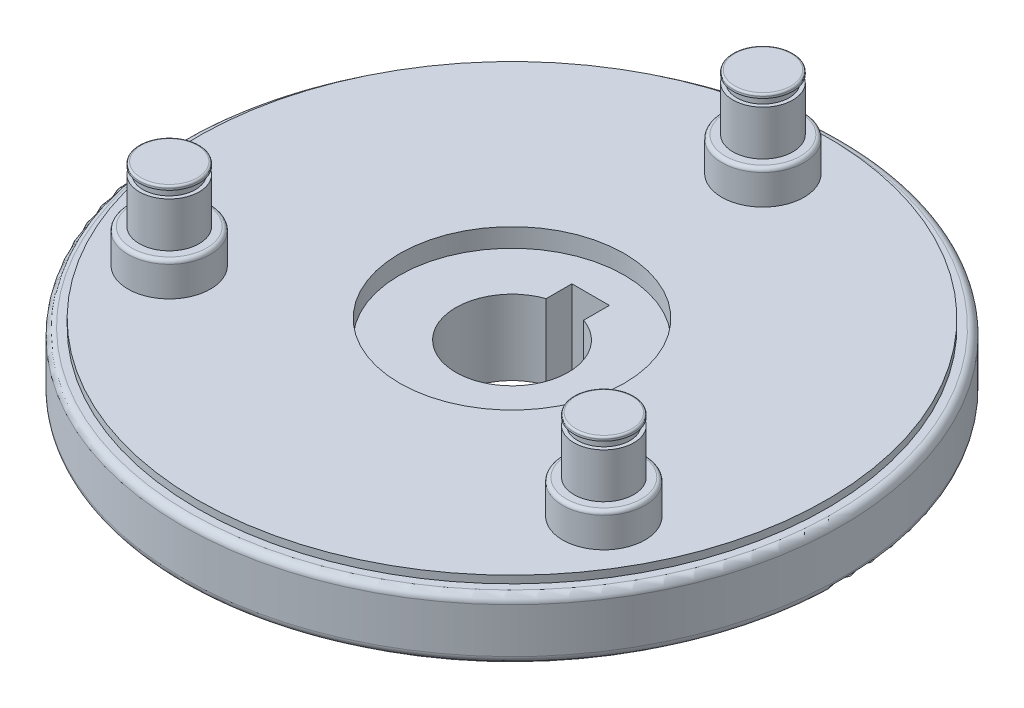
ISO-10303-21;
HEADER;
FILE_DESCRIPTION(('STEP AP214'),'2;1');
FILE_NAME('part.step','',(''),(''),'','','');
FILE_SCHEMA(('AUTOMOTIVE_DESIGN { 1 0 10303 214 1 1 1 1 }'));
ENDSEC;
DATA;
#1=APPLICATION_CONTEXT('core data for automotive mechanical design processes');
#2=APPLICATION_PROTOCOL_DEFINITION('international standard','automotive_design',2000,#1);
#3=PRODUCT_CONTEXT('',#1,'mechanical');
#4=PRODUCT('Part','Part','',(#3));
#5=PRODUCT_RELATED_PRODUCT_CATEGORY('part','',(#4));
#6=PRODUCT_DEFINITION_FORMATION('','',#4);
#7=PRODUCT_DEFINITION_CONTEXT('part definition',#1,'design');
#8=PRODUCT_DEFINITION('design','',#6,#7);
#9=PRODUCT_DEFINITION_SHAPE('','',#8);
#10=(LENGTH_UNIT() NAMED_UNIT(*) SI_UNIT(.MILLI.,.METRE.));
#11=(NAMED_UNIT(*) PLANE_ANGLE_UNIT() SI_UNIT($,.RADIAN.));
#12=(NAMED_UNIT(*) SI_UNIT($,.STERADIAN.) SOLID_ANGLE_UNIT());
#13=UNCERTAINTY_MEASURE_WITH_UNIT(LENGTH_MEASURE(1.E-05),#10,'distance_accuracy_value','');
#14=(GEOMETRIC_REPRESENTATION_CONTEXT(3) GLOBAL_UNCERTAINTY_ASSIGNED_CONTEXT((#13)) GLOBAL_UNIT_ASSIGNED_CONTEXT((#10,
#11,#12)) REPRESENTATION_CONTEXT('',''));
#15=CARTESIAN_POINT('',(0.,0.,0.));
#16=DIRECTION('',(0.,0.,1.));
#17=DIRECTION('',(1.,0.,0.));
#18=AXIS2_PLACEMENT_3D('',#15,#16,#17);
#19=CARTESIAN_POINT('',(29.0118510267788,20.5,16.7499999999997));
#20=DIRECTION('',(0.,1.,0.));
#21=DIRECTION('',(0.,0.,1.));
#22=AXIS2_PLACEMENT_3D('',#19,#20,#21);
#23=CYLINDRICAL_SURFACE('',#22,3.5);
#24=CARTESIAN_POINT('',(29.0118510267788,20.5,16.7499999999997));
#25=DIRECTION('',(0.,1.,0.));
#26=DIRECTION('',(-0.866025403784443,0.,-0.499999999999992));
#27=AXIS2_PLACEMENT_3D('',#24,#25,#26);
#28=CIRCLE('',#27,3.5);
#29=CARTESIAN_POINT('',(25.9807621135333,20.5,14.9999999999998));
#30=VERTEX_POINT('',#29);
#31=EDGE_CURVE('E195',#30,#30,#28,.T.);
#32=ORIENTED_EDGE('',*,*,#31,.T.);
#33=EDGE_LOOP('',(#32));
#34=FACE_BOUND('',#33,.T.);
#35=CARTESIAN_POINT('',(29.0118510267788,21.5,16.7499999999997));
#36=DIRECTION('',(0.,1.,0.));
#37=DIRECTION('',(0.,0.,1.));
#38=AXIS2_PLACEMENT_3D('',#35,#36,#37);
#39=CIRCLE('',#38,3.5);
#40=CARTESIAN_POINT('',(29.0118510267788,21.5,20.2499999999997));
#41=VERTEX_POINT('',#40);
#42=EDGE_CURVE('E197',#41,#41,#39,.F.);
#43=ORIENTED_EDGE('',*,*,#42,.T.);
#44=EDGE_LOOP('',(#43));
#45=FACE_BOUND('',#44,.T.);
#46=ADVANCED_FACE('F38',(#34,#45),#23,.T.);
#47=CARTESIAN_POINT('',(-29.0118510267786,20.5,16.7500000000001));
#48=DIRECTION('',(0.,1.,0.));
#49=DIRECTION('',(0.,0.,1.));
#50=AXIS2_PLACEMENT_3D('',#47,#48,#49);
#51=CYLINDRICAL_SURFACE('',#50,3.5);
#52=CARTESIAN_POINT('',(-29.0118510267786,20.5,16.7500000000001));
#53=DIRECTION('',(0.,1.,0.));
#54=DIRECTION('',(0.866025403784436,0.,-0.500000000000004));
#55=AXIS2_PLACEMENT_3D('',#52,#53,#54);
#56=CIRCLE('',#55,3.5);
#57=CARTESIAN_POINT('',(-25.9807621135331,20.5,15.0000000000001));
#58=VERTEX_POINT('',#57);
#59=EDGE_CURVE('E409',#58,#58,#56,.T.);
#60=ORIENTED_EDGE('',*,*,#59,.T.);
#61=EDGE_LOOP('',(#60));
#62=FACE_BOUND('',#61,.T.);
#63=CARTESIAN_POINT('',(-29.0118510267786,21.5,16.7500000000001));
#64=DIRECTION('',(0.,1.,0.));
#65=DIRECTION('',(0.,0.,1.));
#66=AXIS2_PLACEMENT_3D('',#63,#64,#65);
#67=CIRCLE('',#66,3.5);
#68=CARTESIAN_POINT('',(-29.0118510267786,21.5,20.2500000000001));
#69=VERTEX_POINT('',#68);
#70=EDGE_CURVE('E192',#69,#69,#67,.F.);
#71=ORIENTED_EDGE('',*,*,#70,.T.);
#72=EDGE_LOOP('',(#71));
#73=FACE_BOUND('',#72,.T.);
#74=ADVANCED_FACE('F219',(#62,#73),#51,.T.);
#75=CARTESIAN_POINT('',(29.0118510267788,14.5,16.7499999999997));
#76=DIRECTION('',(0.,1.,0.));
#77=DIRECTION('',(0.,0.,1.));
#78=AXIS2_PLACEMENT_3D('',#75,#76,#77);
#79=CYLINDRICAL_SURFACE('',#78,4.);
#80=CARTESIAN_POINT('',(29.0118510267788,14.5,16.7499999999997));
#81=DIRECTION('',(0.,1.,0.));
#82=DIRECTION('',(-0.866025403784443,0.,-0.499999999999992));
#83=AXIS2_PLACEMENT_3D('',#80,#81,#82);
#84=CIRCLE('',#83,4.);
#85=CARTESIAN_POINT('',(25.5477494116411,14.5,14.7499999999998));
#86=VERTEX_POINT('',#85);
#87=EDGE_CURVE('E401',#86,#86,#84,.T.);
#88=ORIENTED_EDGE('',*,*,#87,.T.);
#89=EDGE_LOOP('',(#88));
#90=FACE_BOUND('',#89,.T.);
#91=CARTESIAN_POINT('',(29.0118510267788,20.5,16.7499999999997));
#92=DIRECTION('',(0.,1.,0.));
#93=DIRECTION('',(-0.866025403784443,0.,-0.499999999999992));
#94=AXIS2_PLACEMENT_3D('',#91,#92,#93);
#95=CIRCLE('',#94,4.);
#96=CARTESIAN_POINT('',(25.5477494116411,20.5,14.7499999999998));
#97=VERTEX_POINT('',#96);
#98=EDGE_CURVE('E453',#97,#97,#95,.T.);
#99=ORIENTED_EDGE('',*,*,#98,.F.);
#100=EDGE_LOOP('',(#99));
#101=FACE_BOUND('',#100,.T.);
#102=ADVANCED_FACE('F225',(#90,#101),#79,.T.);
#103=CARTESIAN_POINT('',(-29.0118510267786,14.5,16.7500000000001));
#104=DIRECTION('',(0.,1.,0.));
#105=DIRECTION('',(0.,0.,1.));
#106=AXIS2_PLACEMENT_3D('',#103,#104,#105);
#107=CYLINDRICAL_SURFACE('',#106,4.);
#108=CARTESIAN_POINT('',(-29.0118510267786,14.5,16.7500000000001));
#109=DIRECTION('',(0.,1.,0.));
#110=DIRECTION('',(0.866025403784436,0.,-0.500000000000004));
#111=AXIS2_PLACEMENT_3D('',#108,#109,#110);
#112=CIRCLE('',#111,4.);
#113=CARTESIAN_POINT('',(-25.5477494116409,14.5,14.7500000000001));
#114=VERTEX_POINT('',#113);
#115=EDGE_CURVE('E402',#114,#114,#112,.T.);
#116=ORIENTED_EDGE('',*,*,#115,.T.);
#117=EDGE_LOOP('',(#116));
#118=FACE_BOUND('',#117,.T.);
#119=CARTESIAN_POINT('',(-29.0118510267786,20.5,16.7500000000001));
#120=DIRECTION('',(0.,1.,0.));
#121=DIRECTION('',(0.866025403784436,0.,-0.500000000000004));
#122=AXIS2_PLACEMENT_3D('',#119,#120,#121);
#123=CIRCLE('',#122,4.);
#124=CARTESIAN_POINT('',(-25.5477494116409,20.5,14.7500000000001));
#125=VERTEX_POINT('',#124);
#126=EDGE_CURVE('E403',#125,#125,#123,.T.);
#127=ORIENTED_EDGE('',*,*,#126,.F.);
#128=EDGE_LOOP('',(#127));
#129=FACE_BOUND('',#128,.T.);
#130=ADVANCED_FACE('F238',(#118,#129),#107,.T.);
#131=CARTESIAN_POINT('',(-29.0118510267786,22.,16.7500000000001));
#132=DIRECTION('',(0.,-1.,0.));
#133=DIRECTION('',(0.,0.,-1.));
#134=AXIS2_PLACEMENT_3D('',#131,#132,#133);
#135=CYLINDRICAL_SURFACE('',#134,5.5);
#136=CARTESIAN_POINT('',(-29.0118510267786,14.,16.7500000000001));
#137=DIRECTION('',(0.,1.,0.));
#138=DIRECTION('',(0.,0.,1.));
#139=AXIS2_PLACEMENT_3D('',#136,#137,#138);
#140=CIRCLE('',#139,5.5);
#141=CARTESIAN_POINT('',(-29.0118510267786,14.,22.2500000000001));
#142=VERTEX_POINT('',#141);
#143=EDGE_CURVE('E182',#142,#142,#140,.F.);
#144=ORIENTED_EDGE('',*,*,#143,.T.);
#145=EDGE_LOOP('',(#144));
#146=FACE_BOUND('',#145,.T.);
#147=CARTESIAN_POINT('',(-29.0118510267786,10.,16.7500000000001));
#148=DIRECTION('',(0.,1.,0.));
#149=DIRECTION('',(0.866025403784436,0.,-0.500000000000004));
#150=AXIS2_PLACEMENT_3D('',#147,#148,#149);
#151=CIRCLE('',#150,5.5);
#152=CARTESIAN_POINT('',(-24.2487113059642,10.,14.0000000000001));
#153=VERTEX_POINT('',#152);
#154=EDGE_CURVE('E415',#153,#153,#151,.T.);
#155=ORIENTED_EDGE('',*,*,#154,.T.);
#156=EDGE_LOOP('',(#155));
#157=FACE_BOUND('',#156,.T.);
#158=ADVANCED_FACE('F241',(#146,#157),#135,.T.);
#159=CARTESIAN_POINT('',(29.0118510267788,22.,16.7499999999997));
#160=DIRECTION('',(0.,-1.,0.));
#161=DIRECTION('',(0.,0.,-1.));
#162=AXIS2_PLACEMENT_3D('',#159,#160,#161);
#163=CYLINDRICAL_SURFACE('',#162,5.5);
#164=CARTESIAN_POINT('',(29.0118510267788,14.,16.7499999999997));
#165=DIRECTION('',(0.,1.,0.));
#166=DIRECTION('',(0.,0.,1.));
#167=AXIS2_PLACEMENT_3D('',#164,#165,#166);
#168=CIRCLE('',#167,5.5);
#169=CARTESIAN_POINT('',(29.0118510267788,14.,22.2499999999997));
#170=VERTEX_POINT('',#169);
#171=EDGE_CURVE('E188',#170,#170,#168,.F.);
#172=ORIENTED_EDGE('',*,*,#171,.T.);
#173=EDGE_LOOP('',(#172));
#174=FACE_BOUND('',#173,.T.);
#175=CARTESIAN_POINT('',(29.0118510267788,10.,16.7499999999997));
#176=DIRECTION('',(0.,1.,0.));
#177=DIRECTION('',(-0.866025403784443,0.,-0.499999999999992));
#178=AXIS2_PLACEMENT_3D('',#175,#176,#177);
#179=CIRCLE('',#178,5.5);
#180=CARTESIAN_POINT('',(24.2487113059644,10.,13.9999999999998));
#181=VERTEX_POINT('',#180);
#182=EDGE_CURVE('E406',#181,#181,#179,.T.);
#183=ORIENTED_EDGE('',*,*,#182,.T.);
#184=EDGE_LOOP('',(#183));
#185=FACE_BOUND('',#184,.T.);
#186=ADVANCED_FACE('F259',(#174,#185),#163,.T.);
#187=CARTESIAN_POINT('',(0.,20.5,-33.5));
#188=DIRECTION('',(0.,1.,0.));
#189=DIRECTION('',(0.,0.,1.));
#190=AXIS2_PLACEMENT_3D('',#187,#188,#189);
#191=CYLINDRICAL_SURFACE('',#190,3.5);
#192=CARTESIAN_POINT('',(0.,20.5,-33.5));
#193=DIRECTION('',(0.,1.,0.));
#194=DIRECTION('',(0.,0.,1.));
#195=AXIS2_PLACEMENT_3D('',#192,#193,#194);
#196=CIRCLE('',#195,3.5);
#197=CARTESIAN_POINT('',(0.,20.5,-30.));
#198=VERTEX_POINT('',#197);
#199=EDGE_CURVE('E172',#198,#198,#196,.T.);
#200=ORIENTED_EDGE('',*,*,#199,.T.);
#201=EDGE_LOOP('',(#200));
#202=FACE_BOUND('',#201,.T.);
#203=CARTESIAN_POINT('',(0.,21.5,-33.5));
#204=DIRECTION('',(0.,1.,0.));
#205=DIRECTION('',(0.,0.,1.));
#206=AXIS2_PLACEMENT_3D('',#203,#204,#205);
#207=CIRCLE('',#206,3.5);
#208=CARTESIAN_POINT('',(0.,21.5,-30.));
#209=VERTEX_POINT('',#208);
#210=EDGE_CURVE('E169',#209,#209,#207,.F.);
#211=ORIENTED_EDGE('',*,*,#210,.T.);
#212=EDGE_LOOP('',(#211));
#213=FACE_BOUND('',#212,.T.);
#214=ADVANCED_FACE('F262',(#202,#213),#191,.T.);
#215=CARTESIAN_POINT('',(0.,14.5,-33.5));
#216=DIRECTION('',(0.,1.,0.));
#217=DIRECTION('',(0.,0.,1.));
#218=AXIS2_PLACEMENT_3D('',#215,#216,#217);
#219=CYLINDRICAL_SURFACE('',#218,4.);
#220=CARTESIAN_POINT('',(0.,14.5,-33.5));
#221=DIRECTION('',(0.,1.,0.));
#222=DIRECTION('',(0.,0.,1.));
#223=AXIS2_PLACEMENT_3D('',#220,#221,#222);
#224=CIRCLE('',#223,4.);
#225=CARTESIAN_POINT('',(0.,14.5,-29.5));
#226=VERTEX_POINT('',#225);
#227=EDGE_CURVE('E425',#226,#226,#224,.T.);
#228=ORIENTED_EDGE('',*,*,#227,.T.);
#229=EDGE_LOOP('',(#228));
#230=FACE_BOUND('',#229,.T.);
#231=CARTESIAN_POINT('',(0.,20.5,-33.5));
#232=DIRECTION('',(0.,1.,0.));
#233=DIRECTION('',(0.,0.,1.));
#234=AXIS2_PLACEMENT_3D('',#231,#232,#233);
#235=CIRCLE('',#234,4.);
#236=CARTESIAN_POINT('',(0.,20.5,-29.5));
#237=VERTEX_POINT('',#236);
#238=EDGE_CURVE('E422',#237,#237,#235,.T.);
#239=ORIENTED_EDGE('',*,*,#238,.F.);
#240=EDGE_LOOP('',(#239));
#241=FACE_BOUND('',#240,.T.);
#242=ADVANCED_FACE('F285',(#230,#241),#219,.T.);
#243=CARTESIAN_POINT('',(0.,22.,-33.5));
#244=DIRECTION('',(0.,-1.,0.));
#245=DIRECTION('',(0.,0.,-1.));
#246=AXIS2_PLACEMENT_3D('',#243,#244,#245);
#247=CYLINDRICAL_SURFACE('',#246,5.5);
#248=CARTESIAN_POINT('',(0.,14.,-33.5));
#249=DIRECTION('',(0.,1.,0.));
#250=DIRECTION('',(0.,0.,1.));
#251=AXIS2_PLACEMENT_3D('',#248,#249,#250);
#252=CIRCLE('',#251,5.5);
#253=CARTESIAN_POINT('',(0.,14.,-28.));
#254=VERTEX_POINT('',#253);
#255=EDGE_CURVE('E165',#254,#254,#252,.F.);
#256=ORIENTED_EDGE('',*,*,#255,.T.);
#257=EDGE_LOOP('',(#256));
#258=FACE_BOUND('',#257,.T.);
#259=CARTESIAN_POINT('',(0.,10.,-33.5));
#260=DIRECTION('',(0.,1.,0.));
#261=DIRECTION('',(0.,0.,1.));
#262=AXIS2_PLACEMENT_3D('',#259,#260,#261);
#263=CIRCLE('',#262,5.5);
#264=CARTESIAN_POINT('',(0.,10.,-28.));
#265=VERTEX_POINT('',#264);
#266=EDGE_CURVE('E94',#265,#265,#263,.T.);
#267=ORIENTED_EDGE('',*,*,#266,.T.);
#268=EDGE_LOOP('',(#267));
#269=FACE_BOUND('',#268,.T.);
#270=ADVANCED_FACE('F293',(#258,#269),#247,.T.);
#271=CARTESIAN_POINT('',(0.,2.,0.));
#272=DIRECTION('',(0.,-1.,0.));
#273=DIRECTION('',(0.,0.,-1.));
#274=AXIS2_PLACEMENT_3D('',#271,#272,#273);
#275=PLANE('',#274);
#276=CARTESIAN_POINT('',(0.,2.,0.));
#277=DIRECTION('',(0.,-1.,0.));
#278=DIRECTION('',(0.,0.,-1.));
#279=AXIS2_PLACEMENT_3D('',#276,#277,#278);
#280=CIRCLE('',#279,15.);
#281=CARTESIAN_POINT('',(0.,2.,-15.));
#282=VERTEX_POINT('',#281);
#283=EDGE_CURVE('E109',#282,#282,#280,.T.);
#284=ORIENTED_EDGE('',*,*,#283,.T.);
#285=EDGE_LOOP('',(#284));
#286=FACE_BOUND('',#285,.T.);
#287=CARTESIAN_POINT('',(0.,2.,0.));
#288=DIRECTION('',(0.,-1.,0.));
#289=DIRECTION('',(0.,0.,-1.));
#290=AXIS2_PLACEMENT_3D('',#287,#288,#289);
#291=CIRCLE('',#290,13.5);
#292=CARTESIAN_POINT('',(0.,2.,-13.5));
#293=VERTEX_POINT('',#292);
#294=EDGE_CURVE('E105',#293,#293,#291,.T.);
#295=ORIENTED_EDGE('',*,*,#294,.F.);
#296=EDGE_LOOP('',(#295));
#297=FACE_BOUND('',#296,.T.);
#298=ADVANCED_FACE('F305',(#286,#297),#275,.T.);
#299=CARTESIAN_POINT('',(0.,-58.,0.));
#300=DIRECTION('',(0.,1.,0.));
#301=DIRECTION('',(0.,0.,1.));
#302=AXIS2_PLACEMENT_3D('',#299,#300,#301);
#303=CYLINDRICAL_SURFACE('',#302,7.5);
#304=DIRECTION('',(0.,1.,0.));
#305=VECTOR('',#304,1.);
#306=CARTESIAN_POINT('',(2.5,-58.,-7.07106781186548));
#307=LINE('',#306,#305);
#308=CARTESIAN_POINT('',(2.5,7.5,-7.07106781186548));
#309=VERTEX_POINT('',#308);
#310=CARTESIAN_POINT('',(2.5,-2.5,-7.07106781186547));
#311=VERTEX_POINT('',#310);
#312=EDGE_CURVE('E61',#309,#311,#307,.F.);
#313=ORIENTED_EDGE('',*,*,#312,.T.);
#314=CARTESIAN_POINT('',(0.,-2.5,0.));
#315=DIRECTION('',(0.,-1.,0.));
#316=DIRECTION('',(0.,0.,-1.));
#317=AXIS2_PLACEMENT_3D('',#314,#315,#316);
#318=CIRCLE('',#317,7.5);
#319=CARTESIAN_POINT('',(-2.5,-2.5,-7.07106781186548));
#320=VERTEX_POINT('',#319);
#321=EDGE_CURVE('E90',#311,#320,#318,.T.);
#322=ORIENTED_EDGE('',*,*,#321,.T.);
#323=DIRECTION('',(0.,1.,0.));
#324=VECTOR('',#323,1.);
#325=CARTESIAN_POINT('',(-2.5,-58.,-7.07106781186548));
#326=LINE('',#325,#324);
#327=CARTESIAN_POINT('',(-2.5,7.5,-7.07106781186548));
#328=VERTEX_POINT('',#327);
#329=EDGE_CURVE('E53',#320,#328,#326,.T.);
#330=ORIENTED_EDGE('',*,*,#329,.T.);
#331=CARTESIAN_POINT('',(0.,7.5,0.));
#332=DIRECTION('',(0.,1.,0.));
#333=DIRECTION('',(0.,0.,1.));
#334=AXIS2_PLACEMENT_3D('',#331,#332,#333);
#335=CIRCLE('',#334,7.5);
#336=EDGE_CURVE('E123',#328,#309,#335,.T.);
#337=ORIENTED_EDGE('',*,*,#336,.T.);
#338=EDGE_LOOP('',(#313,#322,#330,#337));
#339=FACE_BOUND('',#338,.T.);
#340=ADVANCED_FACE('F91',(#339),#303,.F.);
#341=CARTESIAN_POINT('',(-2.5,-58.,-10.5));
#342=DIRECTION('',(0.,0.,-1.));
#343=DIRECTION('',(-1.,0.,0.));
#344=AXIS2_PLACEMENT_3D('',#341,#342,#343);
#345=PLANE('',#344);
#346=DIRECTION('',(0.,1.,0.));
#347=VECTOR('',#346,1.);
#348=CARTESIAN_POINT('',(-2.5,-58.,-10.5));
#349=LINE('',#348,#347);
#350=CARTESIAN_POINT('',(-2.5,-2.5,-10.5));
#351=VERTEX_POINT('',#350);
#352=CARTESIAN_POINT('',(-2.5,7.5,-10.5));
#353=VERTEX_POINT('',#352);
#354=EDGE_CURVE('E121',#351,#353,#349,.T.);
#355=ORIENTED_EDGE('',*,*,#354,.F.);
#356=DIRECTION('',(1.,0.,0.));
#357=VECTOR('',#356,1.);
#358=CARTESIAN_POINT('',(-2.5,-2.5,-10.5));
#359=LINE('',#358,#357);
#360=CARTESIAN_POINT('',(2.5,-2.5,-10.5));
#361=VERTEX_POINT('',#360);
#362=EDGE_CURVE('E98',#351,#361,#359,.T.);
#363=ORIENTED_EDGE('',*,*,#362,.T.);
#364=DIRECTION('',(0.,1.,0.));
#365=VECTOR('',#364,1.);
#366=CARTESIAN_POINT('',(2.5,-58.,-10.5));
#367=LINE('',#366,#365);
#368=CARTESIAN_POINT('',(2.5,7.5,-10.5));
#369=VERTEX_POINT('',#368);
#370=EDGE_CURVE('E120',#361,#369,#367,.T.);
#371=ORIENTED_EDGE('',*,*,#370,.T.);
#372=DIRECTION('',(-1.,0.,0.));
#373=VECTOR('',#372,1.);
#374=CARTESIAN_POINT('',(-2.5,7.5,-10.5));
#375=LINE('',#374,#373);
#376=EDGE_CURVE('E116',#369,#353,#375,.T.);
#377=ORIENTED_EDGE('',*,*,#376,.T.);
#378=EDGE_LOOP('',(#355,#363,#371,#377));
#379=FACE_BOUND('',#378,.T.);
#380=ADVANCED_FACE('F326',(#379),#345,.F.);
#381=CARTESIAN_POINT('',(2.5,-58.,-4.5));
#382=DIRECTION('',(1.,0.,0.));
#383=DIRECTION('',(0.,0.,-1.));
#384=AXIS2_PLACEMENT_3D('',#381,#382,#383);
#385=PLANE('',#384);
#386=ORIENTED_EDGE('',*,*,#370,.F.);
#387=DIRECTION('',(0.,0.,1.));
#388=VECTOR('',#387,1.);
#389=CARTESIAN_POINT('',(2.5,-2.5,-10.5));
#390=LINE('',#389,#388);
#391=EDGE_CURVE('E100',#361,#311,#390,.T.);
#392=ORIENTED_EDGE('',*,*,#391,.T.);
#393=ORIENTED_EDGE('',*,*,#312,.F.);
#394=DIRECTION('',(0.,0.,-1.));
#395=VECTOR('',#394,1.);
#396=CARTESIAN_POINT('',(2.5,7.5,-4.5));
#397=LINE('',#396,#395);
#398=EDGE_CURVE('E112',#309,#369,#397,.T.);
#399=ORIENTED_EDGE('',*,*,#398,.T.);
#400=EDGE_LOOP('',(#386,#392,#393,#399));
#401=FACE_BOUND('',#400,.T.);
#402=ADVANCED_FACE('F325',(#401),#385,.F.);
#403=CARTESIAN_POINT('',(-2.5,-58.,-4.5));
#404=DIRECTION('',(-1.,0.,0.));
#405=DIRECTION('',(0.,0.,1.));
#406=AXIS2_PLACEMENT_3D('',#403,#404,#405);
#407=PLANE('',#406);
#408=ORIENTED_EDGE('',*,*,#329,.F.);
#409=DIRECTION('',(0.,0.,-1.));
#410=VECTOR('',#409,1.);
#411=CARTESIAN_POINT('',(-2.5,-2.5,-7.07106781186548));
#412=LINE('',#411,#410);
#413=EDGE_CURVE('E82',#320,#351,#412,.T.);
#414=ORIENTED_EDGE('',*,*,#413,.T.);
#415=ORIENTED_EDGE('',*,*,#354,.T.);
#416=DIRECTION('',(0.,0.,1.));
#417=VECTOR('',#416,1.);
#418=CARTESIAN_POINT('',(-2.5,7.5,-4.5));
#419=LINE('',#418,#417);
#420=EDGE_CURVE('E85',#353,#328,#419,.T.);
#421=ORIENTED_EDGE('',*,*,#420,.T.);
#422=EDGE_LOOP('',(#408,#414,#415,#421));
#423=FACE_BOUND('',#422,.T.);
#424=ADVANCED_FACE('F80',(#423),#407,.F.);
#425=CARTESIAN_POINT('',(0.,10.,0.));
#426=DIRECTION('',(0.,-1.,0.));
#427=DIRECTION('',(0.,0.,-1.));
#428=AXIS2_PLACEMENT_3D('',#425,#426,#427);
#429=CYLINDRICAL_SURFACE('',#428,44.);
#430=CARTESIAN_POINT('',(0.,2.,0.));
#431=DIRECTION('',(0.,-1.,0.));
#432=DIRECTION('',(0.,0.,-1.));
#433=AXIS2_PLACEMENT_3D('',#430,#431,#432);
#434=CIRCLE('',#433,44.);
#435=CARTESIAN_POINT('',(0.,2.,-44.));
#436=VERTEX_POINT('',#435);
#437=EDGE_CURVE('E147',#436,#436,#434,.F.);
#438=ORIENTED_EDGE('',*,*,#437,.T.);
#439=EDGE_LOOP('',(#438));
#440=FACE_BOUND('',#439,.T.);
#441=CARTESIAN_POINT('',(0.,8.,0.));
#442=DIRECTION('',(0.,1.,0.));
#443=DIRECTION('',(0.,0.,1.));
#444=AXIS2_PLACEMENT_3D('',#441,#442,#443);
#445=CIRCLE('',#444,44.);
#446=CARTESIAN_POINT('',(0.,8.,44.));
#447=VERTEX_POINT('',#446);
#448=EDGE_CURVE('E142',#447,#447,#445,.F.);
#449=ORIENTED_EDGE('',*,*,#448,.T.);
#450=EDGE_LOOP('',(#449));
#451=FACE_BOUND('',#450,.T.);
#452=ADVANCED_FACE('F324',(#440,#451),#429,.T.);
#453=CARTESIAN_POINT('',(0.,9.,0.));
#454=DIRECTION('',(0.,1.,0.));
#455=DIRECTION('',(0.,0.,1.));
#456=AXIS2_PLACEMENT_3D('',#453,#454,#455);
#457=PLANE('',#456);
#458=CARTESIAN_POINT('',(0.,9.,0.));
#459=DIRECTION('',(0.,1.,0.));
#460=DIRECTION('',(0.,0.,1.));
#461=AXIS2_PLACEMENT_3D('',#458,#459,#460);
#462=CIRCLE('',#461,43.);
#463=CARTESIAN_POINT('',(0.,9.,43.));
#464=VERTEX_POINT('',#463);
#465=EDGE_CURVE('E87',#464,#464,#462,.T.);
#466=ORIENTED_EDGE('',*,*,#465,.T.);
#467=EDGE_LOOP('',(#466));
#468=FACE_BOUND('',#467,.T.);
#469=CARTESIAN_POINT('',(0.,9.,0.));
#470=DIRECTION('',(0.,1.,0.));
#471=DIRECTION('',(0.,0.,1.));
#472=AXIS2_PLACEMENT_3D('',#469,#470,#471);
#473=CIRCLE('',#472,42.);
#474=CARTESIAN_POINT('',(0.,9.,42.));
#475=VERTEX_POINT('',#474);
#476=EDGE_CURVE('E139',#475,#475,#473,.T.);
#477=ORIENTED_EDGE('',*,*,#476,.F.);
#478=EDGE_LOOP('',(#477));
#479=FACE_BOUND('',#478,.T.);
#480=ADVANCED_FACE('F355',(#468,#479),#457,.T.);
#481=CARTESIAN_POINT('',(0.,9.,0.));
#482=DIRECTION('',(0.,1.,0.));
#483=DIRECTION('',(0.,0.,1.));
#484=AXIS2_PLACEMENT_3D('',#481,#482,#483);
#485=CYLINDRICAL_SURFACE('',#484,42.);
#486=ORIENTED_EDGE('',*,*,#476,.T.);
#487=EDGE_LOOP('',(#486));
#488=FACE_BOUND('',#487,.T.);
#489=CARTESIAN_POINT('',(0.,10.,0.));
#490=DIRECTION('',(0.,1.,0.));
#491=DIRECTION('',(0.,0.,1.));
#492=AXIS2_PLACEMENT_3D('',#489,#490,#491);
#493=CIRCLE('',#492,42.);
#494=CARTESIAN_POINT('',(0.,10.,42.));
#495=VERTEX_POINT('',#494);
#496=EDGE_CURVE('E136',#495,#495,#493,.T.);
#497=ORIENTED_EDGE('',*,*,#496,.F.);
#498=EDGE_LOOP('',(#497));
#499=FACE_BOUND('',#498,.T.);
#500=ADVANCED_FACE('F352',(#488,#499),#485,.T.);
#501=CARTESIAN_POINT('',(0.,10.,0.));
#502=DIRECTION('',(0.,1.,0.));
#503=DIRECTION('',(0.,0.,1.));
#504=AXIS2_PLACEMENT_3D('',#501,#502,#503);
#505=PLANE('',#504);
#506=ORIENTED_EDGE('',*,*,#182,.F.);
#507=EDGE_LOOP('',(#506));
#508=FACE_BOUND('',#507,.T.);
#509=ORIENTED_EDGE('',*,*,#154,.F.);
#510=EDGE_LOOP('',(#509));
#511=FACE_BOUND('',#510,.T.);
#512=ORIENTED_EDGE('',*,*,#266,.F.);
#513=EDGE_LOOP('',(#512));
#514=FACE_BOUND('',#513,.T.);
#515=CARTESIAN_POINT('',(0.,10.,0.));
#516=DIRECTION('',(0.,1.,0.));
#517=DIRECTION('',(0.,0.,1.));
#518=AXIS2_PLACEMENT_3D('',#515,#516,#517);
#519=CIRCLE('',#518,15.);
#520=CARTESIAN_POINT('',(0.,10.,15.));
#521=VERTEX_POINT('',#520);
#522=EDGE_CURVE('E126',#521,#521,#519,.T.);
#523=ORIENTED_EDGE('',*,*,#522,.F.);
#524=EDGE_LOOP('',(#523));
#525=FACE_BOUND('',#524,.T.);
#526=ORIENTED_EDGE('',*,*,#496,.T.);
#527=EDGE_LOOP('',(#526));
#528=FACE_BOUND('',#527,.T.);
#529=ADVANCED_FACE('F350',(#508,#511,#514,#525,#528),#505,.T.);
#530=CARTESIAN_POINT('',(0.,1.,0.));
#531=DIRECTION('',(0.,-1.,0.));
#532=DIRECTION('',(0.,0.,1.));
#533=AXIS2_PLACEMENT_3D('',#530,#531,#532);
#534=PLANE('',#533);
#535=CARTESIAN_POINT('',(0.,1.,0.));
#536=DIRECTION('',(0.,-1.,0.));
#537=DIRECTION('',(0.,0.,-1.));
#538=AXIS2_PLACEMENT_3D('',#535,#536,#537);
#539=CIRCLE('',#538,43.);
#540=CARTESIAN_POINT('',(0.,1.,-43.));
#541=VERTEX_POINT('',#540);
#542=EDGE_CURVE('E150',#541,#541,#539,.T.);
#543=ORIENTED_EDGE('',*,*,#542,.T.);
#544=EDGE_LOOP('',(#543));
#545=FACE_BOUND('',#544,.T.);
#546=CARTESIAN_POINT('',(0.,1.,0.));
#547=DIRECTION('',(0.,1.,0.));
#548=DIRECTION('',(0.,0.,1.));
#549=AXIS2_PLACEMENT_3D('',#546,#547,#548);
#550=CIRCLE('',#549,42.);
#551=CARTESIAN_POINT('',(0.,1.,42.));
#552=VERTEX_POINT('',#551);
#553=EDGE_CURVE('E133',#552,#552,#550,.T.);
#554=ORIENTED_EDGE('',*,*,#553,.T.);
#555=EDGE_LOOP('',(#554));
#556=FACE_BOUND('',#555,.T.);
#557=ADVANCED_FACE('F346',(#545,#556),#534,.T.);
#558=CARTESIAN_POINT('',(0.,1.,0.));
#559=DIRECTION('',(0.,-1.,0.));
#560=DIRECTION('',(0.,0.,-1.));
#561=AXIS2_PLACEMENT_3D('',#558,#559,#560);
#562=CYLINDRICAL_SURFACE('',#561,42.);
#563=ORIENTED_EDGE('',*,*,#553,.F.);
#564=EDGE_LOOP('',(#563));
#565=FACE_BOUND('',#564,.T.);
#566=CARTESIAN_POINT('',(0.,0.,0.));
#567=DIRECTION('',(0.,1.,0.));
#568=DIRECTION('',(0.,0.,1.));
#569=AXIS2_PLACEMENT_3D('',#566,#567,#568);
#570=CIRCLE('',#569,42.);
#571=CARTESIAN_POINT('',(0.,0.,42.));
#572=VERTEX_POINT('',#571);
#573=EDGE_CURVE('E130',#572,#572,#570,.T.);
#574=ORIENTED_EDGE('',*,*,#573,.T.);
#575=EDGE_LOOP('',(#574));
#576=FACE_BOUND('',#575,.T.);
#577=ADVANCED_FACE('F342',(#565,#576),#562,.T.);
#578=CARTESIAN_POINT('',(0.,0.,0.));
#579=DIRECTION('',(0.,1.,0.));
#580=DIRECTION('',(0.,0.,1.));
#581=AXIS2_PLACEMENT_3D('',#578,#579,#580);
#582=PLANE('',#581);
#583=CARTESIAN_POINT('',(0.,0.,0.));
#584=DIRECTION('',(0.,-1.,0.));
#585=DIRECTION('',(0.,0.,-1.));
#586=AXIS2_PLACEMENT_3D('',#583,#584,#585);
#587=CIRCLE('',#586,15.);
#588=CARTESIAN_POINT('',(0.,0.,-15.));
#589=VERTEX_POINT('',#588);
#590=EDGE_CURVE('E108',#589,#589,#587,.T.);
#591=ORIENTED_EDGE('',*,*,#590,.F.);
#592=EDGE_LOOP('',(#591));
#593=FACE_BOUND('',#592,.T.);
#594=ORIENTED_EDGE('',*,*,#573,.F.);
#595=EDGE_LOOP('',(#594));
#596=FACE_BOUND('',#595,.T.);
#597=ADVANCED_FACE('F345',(#593,#596),#582,.F.);
#598=CARTESIAN_POINT('',(0.,2.,0.));
#599=DIRECTION('',(0.,-1.,0.));
#600=DIRECTION('',(0.,0.,-1.));
#601=AXIS2_PLACEMENT_3D('',#598,#599,#600);
#602=TOROIDAL_SURFACE('',#601,43.,1.);
#603=ORIENTED_EDGE('',*,*,#542,.F.);
#604=EDGE_LOOP('',(#603));
#605=FACE_BOUND('',#604,.T.);
#606=ORIENTED_EDGE('',*,*,#437,.F.);
#607=EDGE_LOOP('',(#606));
#608=FACE_BOUND('',#607,.T.);
#609=ADVANCED_FACE('F365',(#605,#608),#602,.T.);
#610=CARTESIAN_POINT('',(0.,8.,0.));
#611=DIRECTION('',(0.,1.,0.));
#612=DIRECTION('',(0.,0.,1.));
#613=AXIS2_PLACEMENT_3D('',#610,#611,#612);
#614=TOROIDAL_SURFACE('',#613,43.,1.);
#615=ORIENTED_EDGE('',*,*,#448,.F.);
#616=EDGE_LOOP('',(#615));
#617=FACE_BOUND('',#616,.T.);
#618=ORIENTED_EDGE('',*,*,#465,.F.);
#619=EDGE_LOOP('',(#618));
#620=FACE_BOUND('',#619,.T.);
#621=ADVANCED_FACE('F340',(#617,#620),#614,.T.);
#622=CARTESIAN_POINT('',(0.,7.5,0.));
#623=DIRECTION('',(0.,1.,0.));
#624=DIRECTION('',(0.,0.,1.));
#625=AXIS2_PLACEMENT_3D('',#622,#623,#624);
#626=CYLINDRICAL_SURFACE('',#625,15.);
#627=CARTESIAN_POINT('',(0.,7.5,0.));
#628=DIRECTION('',(0.,1.,0.));
#629=DIRECTION('',(0.,0.,1.));
#630=AXIS2_PLACEMENT_3D('',#627,#628,#629);
#631=CIRCLE('',#630,15.);
#632=CARTESIAN_POINT('',(0.,7.5,15.));
#633=VERTEX_POINT('',#632);
#634=EDGE_CURVE('E127',#633,#633,#631,.T.);
#635=ORIENTED_EDGE('',*,*,#634,.F.);
#636=EDGE_LOOP('',(#635));
#637=FACE_BOUND('',#636,.T.);
#638=ORIENTED_EDGE('',*,*,#522,.T.);
#639=EDGE_LOOP('',(#638));
#640=FACE_BOUND('',#639,.T.);
#641=ADVANCED_FACE('F336',(#637,#640),#626,.F.);
#642=CARTESIAN_POINT('',(0.,7.5,0.));
#643=DIRECTION('',(0.,1.,0.));
#644=DIRECTION('',(0.,0.,1.));
#645=AXIS2_PLACEMENT_3D('',#642,#643,#644);
#646=PLANE('',#645);
#647=ORIENTED_EDGE('',*,*,#398,.F.);
#648=ORIENTED_EDGE('',*,*,#336,.F.);
#649=ORIENTED_EDGE('',*,*,#420,.F.);
#650=ORIENTED_EDGE('',*,*,#376,.F.);
#651=EDGE_LOOP('',(#647,#648,#649,#650));
#652=FACE_BOUND('',#651,.T.);
#653=ORIENTED_EDGE('',*,*,#634,.T.);
#654=EDGE_LOOP('',(#653));
#655=FACE_BOUND('',#654,.T.);
#656=ADVANCED_FACE('F320',(#652,#655),#646,.T.);
#657=CARTESIAN_POINT('',(0.,2.,0.));
#658=DIRECTION('',(0.,-1.,0.));
#659=DIRECTION('',(0.,0.,-1.));
#660=AXIS2_PLACEMENT_3D('',#657,#658,#659);
#661=CYLINDRICAL_SURFACE('',#660,15.);
#662=ORIENTED_EDGE('',*,*,#283,.F.);
#663=EDGE_LOOP('',(#662));
#664=FACE_BOUND('',#663,.T.);
#665=ORIENTED_EDGE('',*,*,#590,.T.);
#666=EDGE_LOOP('',(#665));
#667=FACE_BOUND('',#666,.T.);
#668=ADVANCED_FACE('F310',(#664,#667),#661,.F.);
#669=CARTESIAN_POINT('',(0.,-2.5,0.));
#670=DIRECTION('',(0.,-1.,0.));
#671=DIRECTION('',(0.,0.,-1.));
#672=AXIS2_PLACEMENT_3D('',#669,#670,#671);
#673=PLANE('',#672);
#674=CARTESIAN_POINT('',(0.,-2.5,0.));
#675=DIRECTION('',(0.,-1.,0.));
#676=DIRECTION('',(0.,0.,-1.));
#677=AXIS2_PLACEMENT_3D('',#674,#675,#676);
#678=CIRCLE('',#677,12.);
#679=CARTESIAN_POINT('',(0.,-2.5,-12.));
#680=VERTEX_POINT('',#679);
#681=EDGE_CURVE('E156',#680,#680,#678,.T.);
#682=ORIENTED_EDGE('',*,*,#681,.T.);
#683=EDGE_LOOP('',(#682));
#684=FACE_BOUND('',#683,.T.);
#685=ORIENTED_EDGE('',*,*,#413,.F.);
#686=ORIENTED_EDGE('',*,*,#321,.F.);
#687=ORIENTED_EDGE('',*,*,#391,.F.);
#688=ORIENTED_EDGE('',*,*,#362,.F.);
#689=EDGE_LOOP('',(#685,#686,#687,#688));
#690=FACE_BOUND('',#689,.T.);
#691=ADVANCED_FACE('F96',(#684,#690),#673,.T.);
#692=CARTESIAN_POINT('',(0.,-2.5,0.));
#693=DIRECTION('',(0.,1.,0.));
#694=DIRECTION('',(0.,0.,1.));
#695=AXIS2_PLACEMENT_3D('',#692,#693,#694);
#696=CYLINDRICAL_SURFACE('',#695,13.5);
#697=CARTESIAN_POINT('',(0.,-0.99999999999999,0.));
#698=DIRECTION('',(0.,-1.,0.));
#699=DIRECTION('',(0.,0.,-1.));
#700=AXIS2_PLACEMENT_3D('',#697,#698,#699);
#701=CIRCLE('',#700,13.5);
#702=CARTESIAN_POINT('',(0.,-0.99999999999999,-13.5));
#703=VERTEX_POINT('',#702);
#704=EDGE_CURVE('E159',#703,#703,#701,.F.);
#705=ORIENTED_EDGE('',*,*,#704,.T.);
#706=EDGE_LOOP('',(#705));
#707=FACE_BOUND('',#706,.T.);
#708=ORIENTED_EDGE('',*,*,#294,.T.);
#709=EDGE_LOOP('',(#708));
#710=FACE_BOUND('',#709,.T.);
#711=ADVANCED_FACE('F309',(#707,#710),#696,.T.);
#712=CARTESIAN_POINT('',(0.,-2.5,0.));
#713=DIRECTION('',(0.,1.,0.));
#714=DIRECTION('',(0.,0.,1.));
#715=AXIS2_PLACEMENT_3D('',#712,#713,#714);
#716=CONICAL_SURFACE('',#715,12.,0.785398163397447);
#717=ORIENTED_EDGE('',*,*,#704,.F.);
#718=EDGE_LOOP('',(#717));
#719=FACE_BOUND('',#718,.T.);
#720=ORIENTED_EDGE('',*,*,#681,.F.);
#721=EDGE_LOOP('',(#720));
#722=FACE_BOUND('',#721,.T.);
#723=ADVANCED_FACE('F298',(#719,#722),#716,.T.);
#724=CARTESIAN_POINT('',(0.,14.5,-33.5));
#725=DIRECTION('',(0.,1.,0.));
#726=DIRECTION('',(0.,0.,1.));
#727=AXIS2_PLACEMENT_3D('',#724,#725,#726);
#728=PLANE('',#727);
#729=CARTESIAN_POINT('',(0.,14.5,-33.5));
#730=DIRECTION('',(0.,1.,0.));
#731=DIRECTION('',(0.,0.,1.));
#732=AXIS2_PLACEMENT_3D('',#729,#730,#731);
#733=CIRCLE('',#732,5.);
#734=CARTESIAN_POINT('',(0.,14.5,-28.5));
#735=VERTEX_POINT('',#734);
#736=EDGE_CURVE('E162',#735,#735,#733,.T.);
#737=ORIENTED_EDGE('',*,*,#736,.T.);
#738=EDGE_LOOP('',(#737));
#739=FACE_BOUND('',#738,.T.);
#740=ORIENTED_EDGE('',*,*,#227,.F.);
#741=EDGE_LOOP('',(#740));
#742=FACE_BOUND('',#741,.T.);
#743=ADVANCED_FACE('F295',(#739,#742),#728,.T.);
#744=CARTESIAN_POINT('',(0.,14.,-33.5));
#745=DIRECTION('',(0.,1.,0.));
#746=DIRECTION('',(0.,0.,1.));
#747=AXIS2_PLACEMENT_3D('',#744,#745,#746);
#748=TOROIDAL_SURFACE('',#747,5.,0.5);
#749=ORIENTED_EDGE('',*,*,#255,.F.);
#750=EDGE_LOOP('',(#749));
#751=FACE_BOUND('',#750,.T.);
#752=ORIENTED_EDGE('',*,*,#736,.F.);
#753=EDGE_LOOP('',(#752));
#754=FACE_BOUND('',#753,.T.);
#755=ADVANCED_FACE('F289',(#751,#754),#748,.T.);
#756=CARTESIAN_POINT('',(0.,20.5,-33.5));
#757=DIRECTION('',(0.,1.,0.));
#758=DIRECTION('',(0.,0.,1.));
#759=AXIS2_PLACEMENT_3D('',#756,#757,#758);
#760=PLANE('',#759);
#761=ORIENTED_EDGE('',*,*,#199,.F.);
#762=EDGE_LOOP('',(#761));
#763=FACE_BOUND('',#762,.T.);
#764=ORIENTED_EDGE('',*,*,#238,.T.);
#765=EDGE_LOOP('',(#764));
#766=FACE_BOUND('',#765,.T.);
#767=ADVANCED_FACE('F281',(#763,#766),#760,.T.);
#768=CARTESIAN_POINT('',(0.,21.5,-33.5));
#769=DIRECTION('',(0.,1.,0.));
#770=DIRECTION('',(0.,0.,1.));
#771=AXIS2_PLACEMENT_3D('',#768,#769,#770);
#772=CYLINDRICAL_SURFACE('',#771,4.);
#773=CARTESIAN_POINT('',(0.,21.75,-33.5));
#774=DIRECTION('',(0.,1.,0.));
#775=DIRECTION('',(0.,0.,1.));
#776=AXIS2_PLACEMENT_3D('',#773,#774,#775);
#777=CIRCLE('',#776,4.);
#778=CARTESIAN_POINT('',(0.,21.75,-29.5));
#779=VERTEX_POINT('',#778);
#780=EDGE_CURVE('E176',#779,#779,#777,.F.);
#781=ORIENTED_EDGE('',*,*,#780,.T.);
#782=EDGE_LOOP('',(#781));
#783=FACE_BOUND('',#782,.T.);
#784=CARTESIAN_POINT('',(0.,21.5,-33.5));
#785=DIRECTION('',(0.,1.,0.));
#786=DIRECTION('',(0.,0.,1.));
#787=AXIS2_PLACEMENT_3D('',#784,#785,#786);
#788=CIRCLE('',#787,4.);
#789=CARTESIAN_POINT('',(0.,21.5,-29.5));
#790=VERTEX_POINT('',#789);
#791=EDGE_CURVE('E173',#790,#790,#788,.T.);
#792=ORIENTED_EDGE('',*,*,#791,.T.);
#793=EDGE_LOOP('',(#792));
#794=FACE_BOUND('',#793,.T.);
#795=ADVANCED_FACE('F277',(#783,#794),#772,.T.);
#796=CARTESIAN_POINT('',(0.,21.5,-33.5));
#797=DIRECTION('',(0.,1.,0.));
#798=DIRECTION('',(0.,0.,1.));
#799=AXIS2_PLACEMENT_3D('',#796,#797,#798);
#800=PLANE('',#799);
#801=ORIENTED_EDGE('',*,*,#210,.F.);
#802=EDGE_LOOP('',(#801));
#803=FACE_BOUND('',#802,.T.);
#804=ORIENTED_EDGE('',*,*,#791,.F.);
#805=EDGE_LOOP('',(#804));
#806=FACE_BOUND('',#805,.T.);
#807=ADVANCED_FACE('F273',(#803,#806),#800,.F.);
#808=CARTESIAN_POINT('',(0.,22.,-33.5));
#809=DIRECTION('',(0.,1.,0.));
#810=DIRECTION('',(0.,0.,1.));
#811=AXIS2_PLACEMENT_3D('',#808,#809,#810);
#812=PLANE('',#811);
#813=CARTESIAN_POINT('',(0.,22.,-33.5));
#814=DIRECTION('',(0.,1.,0.));
#815=DIRECTION('',(0.,0.,1.));
#816=AXIS2_PLACEMENT_3D('',#813,#814,#815);
#817=CIRCLE('',#816,3.75);
#818=CARTESIAN_POINT('',(0.,22.,-29.75));
#819=VERTEX_POINT('',#818);
#820=EDGE_CURVE('E168',#819,#819,#817,.T.);
#821=ORIENTED_EDGE('',*,*,#820,.T.);
#822=EDGE_LOOP('',(#821));
#823=FACE_BOUND('',#822,.T.);
#824=ADVANCED_FACE('F276',(#823),#812,.T.);
#825=CARTESIAN_POINT('',(0.,21.75,-33.5));
#826=DIRECTION('',(0.,1.,0.));
#827=DIRECTION('',(0.,0.,1.));
#828=AXIS2_PLACEMENT_3D('',#825,#826,#827);
#829=TOROIDAL_SURFACE('',#828,3.75,0.25);
#830=ORIENTED_EDGE('',*,*,#780,.F.);
#831=EDGE_LOOP('',(#830));
#832=FACE_BOUND('',#831,.T.);
#833=ORIENTED_EDGE('',*,*,#820,.F.);
#834=EDGE_LOOP('',(#833));
#835=FACE_BOUND('',#834,.T.);
#836=ADVANCED_FACE('F254',(#832,#835),#829,.T.);
#837=CARTESIAN_POINT('',(29.0118510267788,14.5,16.7499999999997));
#838=DIRECTION('',(0.,1.,0.));
#839=DIRECTION('',(-0.866025403784443,0.,-0.499999999999992));
#840=AXIS2_PLACEMENT_3D('',#837,#838,#839);
#841=PLANE('',#840);
#842=CARTESIAN_POINT('',(29.0118510267788,14.5,16.7499999999997));
#843=DIRECTION('',(0.,1.,0.));
#844=DIRECTION('',(0.,0.,1.));
#845=AXIS2_PLACEMENT_3D('',#842,#843,#844);
#846=CIRCLE('',#845,5.);
#847=CARTESIAN_POINT('',(29.0118510267788,14.5,21.7499999999997));
#848=VERTEX_POINT('',#847);
#849=EDGE_CURVE('E185',#848,#848,#846,.T.);
#850=ORIENTED_EDGE('',*,*,#849,.T.);
#851=EDGE_LOOP('',(#850));
#852=FACE_BOUND('',#851,.T.);
#853=ORIENTED_EDGE('',*,*,#87,.F.);
#854=EDGE_LOOP('',(#853));
#855=FACE_BOUND('',#854,.T.);
#856=ADVANCED_FACE('F247',(#852,#855),#841,.T.);
#857=CARTESIAN_POINT('',(-29.0118510267786,14.5,16.7500000000001));
#858=DIRECTION('',(0.,1.,0.));
#859=DIRECTION('',(0.866025403784436,0.,-0.500000000000004));
#860=AXIS2_PLACEMENT_3D('',#857,#858,#859);
#861=PLANE('',#860);
#862=CARTESIAN_POINT('',(-29.0118510267786,14.5,16.7500000000001));
#863=DIRECTION('',(0.,1.,0.));
#864=DIRECTION('',(0.,0.,1.));
#865=AXIS2_PLACEMENT_3D('',#862,#863,#864);
#866=CIRCLE('',#865,5.);
#867=CARTESIAN_POINT('',(-29.0118510267786,14.5,21.7500000000001));
#868=VERTEX_POINT('',#867);
#869=EDGE_CURVE('E179',#868,#868,#866,.T.);
#870=ORIENTED_EDGE('',*,*,#869,.T.);
#871=EDGE_LOOP('',(#870));
#872=FACE_BOUND('',#871,.T.);
#873=ORIENTED_EDGE('',*,*,#115,.F.);
#874=EDGE_LOOP('',(#873));
#875=FACE_BOUND('',#874,.T.);
#876=ADVANCED_FACE('F243',(#872,#875),#861,.T.);
#877=CARTESIAN_POINT('',(-29.0118510267786,14.,16.7500000000001));
#878=DIRECTION('',(0.,1.,0.));
#879=DIRECTION('',(0.,0.,1.));
#880=AXIS2_PLACEMENT_3D('',#877,#878,#879);
#881=TOROIDAL_SURFACE('',#880,5.,0.5);
#882=ORIENTED_EDGE('',*,*,#143,.F.);
#883=EDGE_LOOP('',(#882));
#884=FACE_BOUND('',#883,.T.);
#885=ORIENTED_EDGE('',*,*,#869,.F.);
#886=EDGE_LOOP('',(#885));
#887=FACE_BOUND('',#886,.T.);
#888=ADVANCED_FACE('F246',(#884,#887),#881,.T.);
#889=CARTESIAN_POINT('',(29.0118510267788,14.,16.7499999999997));
#890=DIRECTION('',(0.,1.,0.));
#891=DIRECTION('',(0.,0.,1.));
#892=AXIS2_PLACEMENT_3D('',#889,#890,#891);
#893=TOROIDAL_SURFACE('',#892,5.,0.5);
#894=ORIENTED_EDGE('',*,*,#171,.F.);
#895=EDGE_LOOP('',(#894));
#896=FACE_BOUND('',#895,.T.);
#897=ORIENTED_EDGE('',*,*,#849,.F.);
#898=EDGE_LOOP('',(#897));
#899=FACE_BOUND('',#898,.T.);
#900=ADVANCED_FACE('F387',(#896,#899),#893,.T.);
#901=CARTESIAN_POINT('',(-29.0118510267786,20.5,16.7500000000001));
#902=DIRECTION('',(0.,1.,0.));
#903=DIRECTION('',(0.866025403784436,0.,-0.500000000000004));
#904=AXIS2_PLACEMENT_3D('',#901,#902,#903);
#905=PLANE('',#904);
#906=ORIENTED_EDGE('',*,*,#59,.F.);
#907=EDGE_LOOP('',(#906));
#908=FACE_BOUND('',#907,.T.);
#909=ORIENTED_EDGE('',*,*,#126,.T.);
#910=EDGE_LOOP('',(#909));
#911=FACE_BOUND('',#910,.T.);
#912=ADVANCED_FACE('F232',(#908,#911),#905,.T.);
#913=CARTESIAN_POINT('',(29.0118510267788,20.5,16.7499999999997));
#914=DIRECTION('',(0.,1.,0.));
#915=DIRECTION('',(-0.866025403784443,0.,-0.499999999999992));
#916=AXIS2_PLACEMENT_3D('',#913,#914,#915);
#917=PLANE('',#916);
#918=ORIENTED_EDGE('',*,*,#31,.F.);
#919=EDGE_LOOP('',(#918));
#920=FACE_BOUND('',#919,.T.);
#921=ORIENTED_EDGE('',*,*,#98,.T.);
#922=EDGE_LOOP('',(#921));
#923=FACE_BOUND('',#922,.T.);
#924=ADVANCED_FACE('F233',(#920,#923),#917,.T.);
#925=CARTESIAN_POINT('',(-29.0118510267786,21.5,16.7500000000001));
#926=DIRECTION('',(0.,1.,0.));
#927=DIRECTION('',(0.,0.,1.));
#928=AXIS2_PLACEMENT_3D('',#925,#926,#927);
#929=CYLINDRICAL_SURFACE('',#928,4.);
#930=CARTESIAN_POINT('',(-29.0118510267786,21.75,16.7500000000001));
#931=DIRECTION('',(0.,1.,0.));
#932=DIRECTION('',(0.,0.,1.));
#933=AXIS2_PLACEMENT_3D('',#930,#931,#932);
#934=CIRCLE('',#933,4.);
#935=CARTESIAN_POINT('',(-29.0118510267786,21.75,20.7500000000001));
#936=VERTEX_POINT('',#935);
#937=EDGE_CURVE('E203',#936,#936,#934,.F.);
#938=ORIENTED_EDGE('',*,*,#937,.T.);
#939=EDGE_LOOP('',(#938));
#940=FACE_BOUND('',#939,.T.);
#941=CARTESIAN_POINT('',(-29.0118510267786,21.5,16.7500000000001));
#942=DIRECTION('',(0.,1.,0.));
#943=DIRECTION('',(0.866025403784436,0.,-0.500000000000004));
#944=AXIS2_PLACEMENT_3D('',#941,#942,#943);
#945=CIRCLE('',#944,4.);
#946=CARTESIAN_POINT('',(-25.5477494116409,21.5,14.7500000000001));
#947=VERTEX_POINT('',#946);
#948=EDGE_CURVE('E196',#947,#947,#945,.T.);
#949=ORIENTED_EDGE('',*,*,#948,.T.);
#950=EDGE_LOOP('',(#949));
#951=FACE_BOUND('',#950,.T.);
#952=ADVANCED_FACE('F236',(#940,#951),#929,.T.);
#953=CARTESIAN_POINT('',(-29.0118510267786,21.5,16.7500000000001));
#954=DIRECTION('',(0.,1.,0.));
#955=DIRECTION('',(0.866025403784436,0.,-0.500000000000004));
#956=AXIS2_PLACEMENT_3D('',#953,#954,#955);
#957=PLANE('',#956);
#958=ORIENTED_EDGE('',*,*,#70,.F.);
#959=EDGE_LOOP('',(#958));
#960=FACE_BOUND('',#959,.T.);
#961=ORIENTED_EDGE('',*,*,#948,.F.);
#962=EDGE_LOOP('',(#961));
#963=FACE_BOUND('',#962,.T.);
#964=ADVANCED_FACE('F268',(#960,#963),#957,.F.);
#965=CARTESIAN_POINT('',(-29.0118510267786,22.,16.7500000000001));
#966=DIRECTION('',(0.,1.,0.));
#967=DIRECTION('',(0.866025403784436,0.,-0.500000000000004));
#968=AXIS2_PLACEMENT_3D('',#965,#966,#967);
#969=PLANE('',#968);
#970=CARTESIAN_POINT('',(-29.0118510267786,22.,16.7500000000001));
#971=DIRECTION('',(0.,1.,0.));
#972=DIRECTION('',(0.,0.,1.));
#973=AXIS2_PLACEMENT_3D('',#970,#971,#972);
#974=CIRCLE('',#973,3.75);
#975=CARTESIAN_POINT('',(-29.0118510267786,22.,20.5000000000001));
#976=VERTEX_POINT('',#975);
#977=EDGE_CURVE('E191',#976,#976,#974,.T.);
#978=ORIENTED_EDGE('',*,*,#977,.T.);
#979=EDGE_LOOP('',(#978));
#980=FACE_BOUND('',#979,.T.);
#981=ADVANCED_FACE('F264',(#980),#969,.T.);
#982=CARTESIAN_POINT('',(29.0118510267788,21.5,16.7499999999997));
#983=DIRECTION('',(0.,1.,0.));
#984=DIRECTION('',(0.,0.,1.));
#985=AXIS2_PLACEMENT_3D('',#982,#983,#984);
#986=CYLINDRICAL_SURFACE('',#985,4.);
#987=CARTESIAN_POINT('',(29.0118510267788,21.75,16.7499999999997));
#988=DIRECTION('',(0.,1.,0.));
#989=DIRECTION('',(0.,0.,1.));
#990=AXIS2_PLACEMENT_3D('',#987,#988,#989);
#991=CIRCLE('',#990,4.);
#992=CARTESIAN_POINT('',(29.0118510267788,21.75,20.7499999999997));
#993=VERTEX_POINT('',#992);
#994=EDGE_CURVE('E11',#993,#993,#991,.F.);
#995=ORIENTED_EDGE('',*,*,#994,.T.);
#996=EDGE_LOOP('',(#995));
#997=FACE_BOUND('',#996,.T.);
#998=CARTESIAN_POINT('',(29.0118510267788,21.5,16.7499999999997));
#999=DIRECTION('',(0.,1.,0.));
#1000=DIRECTION('',(-0.866025403784443,0.,-0.499999999999992));
#1001=AXIS2_PLACEMENT_3D('',#998,#999,#1000);
#1002=CIRCLE('',#1001,4.);
#1003=CARTESIAN_POINT('',(25.5477494116411,21.5,14.7499999999998));
#1004=VERTEX_POINT('',#1003);
#1005=EDGE_CURVE('E200',#1004,#1004,#1002,.T.);
#1006=ORIENTED_EDGE('',*,*,#1005,.T.);
#1007=EDGE_LOOP('',(#1006));
#1008=FACE_BOUND('',#1007,.T.);
#1009=ADVANCED_FACE('F267',(#997,#1008),#986,.T.);
#1010=CARTESIAN_POINT('',(29.0118510267788,21.5,16.7499999999997));
#1011=DIRECTION('',(0.,1.,0.));
#1012=DIRECTION('',(-0.866025403784443,0.,-0.499999999999992));
#1013=AXIS2_PLACEMENT_3D('',#1010,#1011,#1012);
#1014=PLANE('',#1013);
#1015=ORIENTED_EDGE('',*,*,#42,.F.);
#1016=EDGE_LOOP('',(#1015));
#1017=FACE_BOUND('',#1016,.T.);
#1018=ORIENTED_EDGE('',*,*,#1005,.F.);
#1019=EDGE_LOOP('',(#1018));
#1020=FACE_BOUND('',#1019,.T.);
#1021=ADVANCED_FACE('F258',(#1017,#1020),#1014,.F.);
#1022=CARTESIAN_POINT('',(29.0118510267788,22.,16.7499999999997));
#1023=DIRECTION('',(0.,1.,0.));
#1024=DIRECTION('',(-0.866025403784443,0.,-0.499999999999992));
#1025=AXIS2_PLACEMENT_3D('',#1022,#1023,#1024);
#1026=PLANE('',#1025);
#1027=CARTESIAN_POINT('',(29.0118510267788,22.,16.7499999999997));
#1028=DIRECTION('',(0.,1.,0.));
#1029=DIRECTION('',(0.,0.,1.));
#1030=AXIS2_PLACEMENT_3D('',#1027,#1028,#1029);
#1031=CIRCLE('',#1030,3.75);
#1032=CARTESIAN_POINT('',(29.0118510267788,22.,20.4999999999997));
#1033=VERTEX_POINT('',#1032);
#1034=EDGE_CURVE('E46',#1033,#1033,#1031,.T.);
#1035=ORIENTED_EDGE('',*,*,#1034,.T.);
#1036=EDGE_LOOP('',(#1035));
#1037=FACE_BOUND('',#1036,.T.);
#1038=ADVANCED_FACE('F208',(#1037),#1026,.T.);
#1039=CARTESIAN_POINT('',(-29.0118510267786,21.75,16.7500000000001));
#1040=DIRECTION('',(0.,1.,0.));
#1041=DIRECTION('',(0.,0.,1.));
#1042=AXIS2_PLACEMENT_3D('',#1039,#1040,#1041);
#1043=TOROIDAL_SURFACE('',#1042,3.75,0.25);
#1044=ORIENTED_EDGE('',*,*,#937,.F.);
#1045=EDGE_LOOP('',(#1044));
#1046=FACE_BOUND('',#1045,.T.);
#1047=ORIENTED_EDGE('',*,*,#977,.F.);
#1048=EDGE_LOOP('',(#1047));
#1049=FACE_BOUND('',#1048,.T.);
#1050=ADVANCED_FACE('F211',(#1046,#1049),#1043,.T.);
#1051=CARTESIAN_POINT('',(29.0118510267788,21.75,16.7499999999997));
#1052=DIRECTION('',(0.,1.,0.));
#1053=DIRECTION('',(0.,0.,1.));
#1054=AXIS2_PLACEMENT_3D('',#1051,#1052,#1053);
#1055=TOROIDAL_SURFACE('',#1054,3.75,0.25);
#1056=ORIENTED_EDGE('',*,*,#994,.F.);
#1057=EDGE_LOOP('',(#1056));
#1058=FACE_BOUND('',#1057,.T.);
#1059=ORIENTED_EDGE('',*,*,#1034,.F.);
#1060=EDGE_LOOP('',(#1059));
#1061=FACE_BOUND('',#1060,.T.);
#1062=ADVANCED_FACE('F40',(#1058,#1061),#1055,.T.);
#1063=CLOSED_SHELL('',(#46,#74,#102,#130,#158,#186,#214,#242,#270,#298,#340,#380,#402,#424,#452,
#480,#500,#529,#557,#577,#597,#609,#621,#641,#656,#668,#691,#711,#723,#743,#755,#767,#795,#807,
#824,#836,#856,#876,#888,#900,#912,#924,#952,#964,#981,#1009,#1021,#1038,#1050,#1062));
#1064=MANIFOLD_SOLID_BREP('B2',#1063);
#1065=ADVANCED_BREP_SHAPE_REPRESENTATION('',(#18,#1064),#14);
#1066=SHAPE_DEFINITION_REPRESENTATION(#9,#1065);
ENDSEC;
END-ISO-10303-21;
